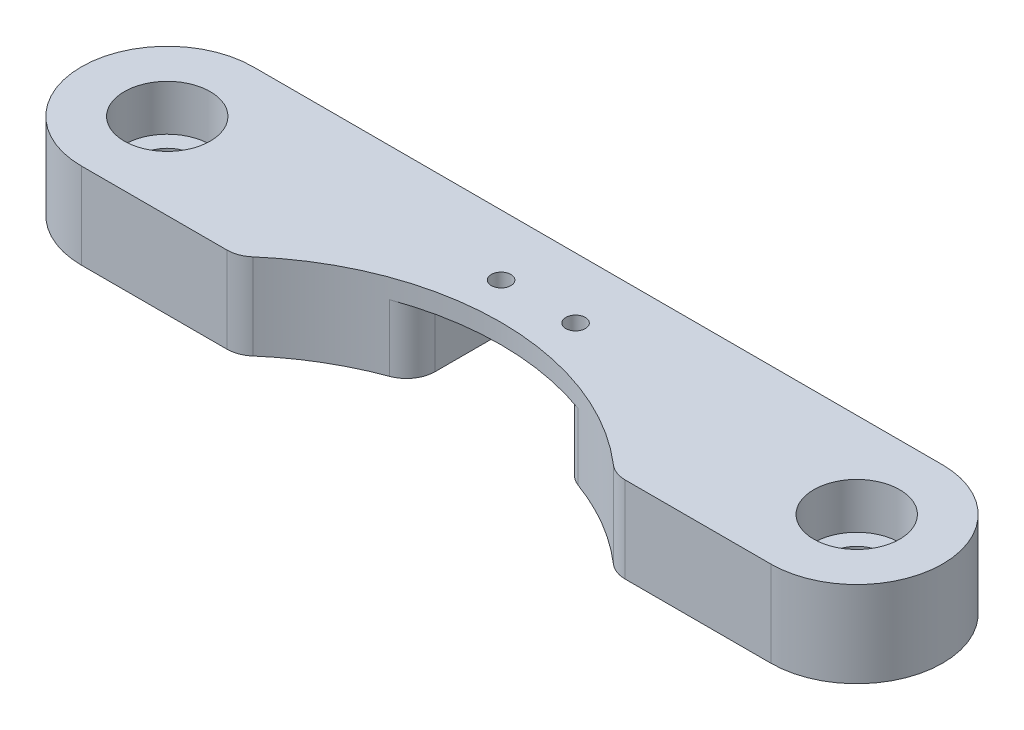
ISO-10303-21;
HEADER;
FILE_DESCRIPTION(('STEP AP214'),'2;1');
FILE_NAME('part.step','',(''),(''),'','','');
FILE_SCHEMA(('AUTOMOTIVE_DESIGN { 1 0 10303 214 1 1 1 1 }'));
ENDSEC;
DATA;
#1=APPLICATION_CONTEXT('core data for automotive mechanical design processes');
#2=APPLICATION_PROTOCOL_DEFINITION('international standard','automotive_design',2000,#1);
#3=PRODUCT_CONTEXT('',#1,'mechanical');
#4=PRODUCT('Part','Part','',(#3));
#5=PRODUCT_RELATED_PRODUCT_CATEGORY('part','',(#4));
#6=PRODUCT_DEFINITION_FORMATION('','',#4);
#7=PRODUCT_DEFINITION_CONTEXT('part definition',#1,'design');
#8=PRODUCT_DEFINITION('design','',#6,#7);
#9=PRODUCT_DEFINITION_SHAPE('','',#8);
#10=(LENGTH_UNIT() NAMED_UNIT(*) SI_UNIT(.MILLI.,.METRE.));
#11=(NAMED_UNIT(*) PLANE_ANGLE_UNIT() SI_UNIT($,.RADIAN.));
#12=(NAMED_UNIT(*) SI_UNIT($,.STERADIAN.) SOLID_ANGLE_UNIT());
#13=UNCERTAINTY_MEASURE_WITH_UNIT(LENGTH_MEASURE(1.E-05),#10,'distance_accuracy_value','');
#14=(GEOMETRIC_REPRESENTATION_CONTEXT(3) GLOBAL_UNCERTAINTY_ASSIGNED_CONTEXT((#13)) GLOBAL_UNIT_ASSIGNED_CONTEXT((#10,
#11,#12)) REPRESENTATION_CONTEXT('',''));
#15=CARTESIAN_POINT('',(0.,0.,0.));
#16=DIRECTION('',(0.,0.,1.));
#17=DIRECTION('',(1.,0.,0.));
#18=AXIS2_PLACEMENT_3D('',#15,#16,#17);
#19=CARTESIAN_POINT('',(30.,52.5,-25.));
#20=DIRECTION('',(0.,-1.,0.));
#21=DIRECTION('',(0.,0.,-1.));
#22=AXIS2_PLACEMENT_3D('',#19,#20,#21);
#23=CYLINDRICAL_SURFACE('',#22,2.25);
#24=CARTESIAN_POINT('',(30.,45.,-25.));
#25=DIRECTION('',(0.,1.,0.));
#26=DIRECTION('',(0.,0.,1.));
#27=AXIS2_PLACEMENT_3D('',#24,#25,#26);
#28=CIRCLE('',#27,2.25);
#29=CARTESIAN_POINT('',(30.,45.,-22.75));
#30=VERTEX_POINT('',#29);
#31=EDGE_CURVE('E305',#30,#30,#28,.T.);
#32=ORIENTED_EDGE('',*,*,#31,.F.);
#33=EDGE_LOOP('',(#32));
#34=FACE_BOUND('',#33,.T.);
#35=CARTESIAN_POINT('',(30.,48.5,-25.));
#36=DIRECTION('',(0.,1.,0.));
#37=DIRECTION('',(0.,0.,1.));
#38=AXIS2_PLACEMENT_3D('',#35,#36,#37);
#39=CIRCLE('',#38,2.25);
#40=CARTESIAN_POINT('',(30.,48.5,-22.75));
#41=VERTEX_POINT('',#40);
#42=EDGE_CURVE('E39',#41,#41,#39,.T.);
#43=ORIENTED_EDGE('',*,*,#42,.T.);
#44=EDGE_LOOP('',(#43));
#45=FACE_BOUND('',#44,.T.);
#46=ADVANCED_FACE('F35',(#34,#45),#23,.F.);
#47=CARTESIAN_POINT('',(-30.2,52.5,-25.));
#48=DIRECTION('',(0.,-1.,0.));
#49=DIRECTION('',(0.,0.,-1.));
#50=AXIS2_PLACEMENT_3D('',#47,#48,#49);
#51=CYLINDRICAL_SURFACE('',#50,2.25);
#52=CARTESIAN_POINT('',(-30.2,45.,-25.));
#53=DIRECTION('',(0.,1.,0.));
#54=DIRECTION('',(0.,0.,1.));
#55=AXIS2_PLACEMENT_3D('',#52,#53,#54);
#56=CIRCLE('',#55,2.25);
#57=CARTESIAN_POINT('',(-30.2,45.,-22.75));
#58=VERTEX_POINT('',#57);
#59=EDGE_CURVE('E300',#58,#58,#56,.T.);
#60=ORIENTED_EDGE('',*,*,#59,.F.);
#61=EDGE_LOOP('',(#60));
#62=FACE_BOUND('',#61,.T.);
#63=CARTESIAN_POINT('',(-30.2,48.5,-25.));
#64=DIRECTION('',(0.,1.,0.));
#65=DIRECTION('',(0.,0.,1.));
#66=AXIS2_PLACEMENT_3D('',#63,#64,#65);
#67=CIRCLE('',#66,2.25);
#68=CARTESIAN_POINT('',(-30.2,48.5,-22.75));
#69=VERTEX_POINT('',#68);
#70=EDGE_CURVE('E259',#69,#69,#67,.T.);
#71=ORIENTED_EDGE('',*,*,#70,.T.);
#72=EDGE_LOOP('',(#71));
#73=FACE_BOUND('',#72,.T.);
#74=ADVANCED_FACE('F342',(#62,#73),#51,.F.);
#75=CARTESIAN_POINT('',(-0.100000000000003,45.,0.));
#76=DIRECTION('',(0.,1.,0.));
#77=DIRECTION('',(0.,0.,1.));
#78=AXIS2_PLACEMENT_3D('',#75,#76,#77);
#79=PLANE('',#78);
#80=ORIENTED_EDGE('',*,*,#59,.T.);
#81=EDGE_LOOP('',(#80));
#82=FACE_BOUND('',#81,.T.);
#83=DIRECTION('',(-1.,0.,0.));
#84=VECTOR('',#83,1.);
#85=CARTESIAN_POINT('',(-30.2,45.,-32.5));
#86=LINE('',#85,#84);
#87=CARTESIAN_POINT('',(-9.2,45.,-32.5));
#88=VERTEX_POINT('',#87);
#89=CARTESIAN_POINT('',(-30.2,45.,-32.5));
#90=VERTEX_POINT('',#89);
#91=EDGE_CURVE('E190',#88,#90,#86,.T.);
#92=ORIENTED_EDGE('',*,*,#91,.F.);
#93=CARTESIAN_POINT('',(-9.2,45.,-30.));
#94=DIRECTION('',(0.,1.,0.));
#95=DIRECTION('',(0.,0.,1.));
#96=AXIS2_PLACEMENT_3D('',#93,#94,#95);
#97=CIRCLE('',#96,2.5);
#98=CARTESIAN_POINT('',(-6.7,45.,-30.));
#99=VERTEX_POINT('',#98);
#100=EDGE_CURVE('E240',#88,#99,#97,.F.);
#101=ORIENTED_EDGE('',*,*,#100,.T.);
#102=DIRECTION('',(0.,0.,1.));
#103=VECTOR('',#102,1.);
#104=CARTESIAN_POINT('',(-6.7,45.,-23.0746614276353));
#105=LINE('',#104,#103);
#106=CARTESIAN_POINT('',(-6.7,45.,-24.888551585016));
#107=VERTEX_POINT('',#106);
#108=EDGE_CURVE('E265',#99,#107,#105,.T.);
#109=ORIENTED_EDGE('',*,*,#108,.T.);
#110=CARTESIAN_POINT('',(-9.2,45.,-24.888551585016));
#111=DIRECTION('',(0.,1.,0.));
#112=DIRECTION('',(0.,0.,1.));
#113=AXIS2_PLACEMENT_3D('',#110,#111,#112);
#114=CIRCLE('',#113,2.5);
#115=CARTESIAN_POINT('',(-8.34150943396227,45.,-22.5405750203918));
#116=VERTEX_POINT('',#115);
#117=EDGE_CURVE('E236',#107,#116,#114,.F.);
#118=ORIENTED_EDGE('',*,*,#117,.T.);
#119=CARTESIAN_POINT('',(-0.100000000000003,45.,0.));
#120=DIRECTION('',(0.,-1.,0.));
#121=DIRECTION('',(0.,0.,1.));
#122=AXIS2_PLACEMENT_3D('',#119,#120,#121);
#123=CIRCLE('',#122,24.);
#124=CARTESIAN_POINT('',(-15.8452123629106,45.,-18.1132075471698));
#125=VERTEX_POINT('',#124);
#126=EDGE_CURVE('E183',#125,#116,#123,.T.);
#127=ORIENTED_EDGE('',*,*,#126,.F.);
#128=CARTESIAN_POINT('',(-17.4853386507137,45.,-20.));
#129=DIRECTION('',(0.,1.,0.));
#130=DIRECTION('',(0.,0.,1.));
#131=AXIS2_PLACEMENT_3D('',#128,#129,#130);
#132=CIRCLE('',#131,2.5);
#133=CARTESIAN_POINT('',(-17.4853386507137,45.,-17.5));
#134=VERTEX_POINT('',#133);
#135=EDGE_CURVE('E238',#125,#134,#132,.F.);
#136=ORIENTED_EDGE('',*,*,#135,.T.);
#137=DIRECTION('',(1.,0.,0.));
#138=VECTOR('',#137,1.);
#139=CARTESIAN_POINT('',(-16.5240677056569,45.,-17.5));
#140=LINE('',#139,#138);
#141=CARTESIAN_POINT('',(-30.2,45.,-17.5));
#142=VERTEX_POINT('',#141);
#143=EDGE_CURVE('E196',#142,#134,#140,.T.);
#144=ORIENTED_EDGE('',*,*,#143,.F.);
#145=CARTESIAN_POINT('',(-30.2,45.,-25.));
#146=DIRECTION('',(0.,1.,0.));
#147=DIRECTION('',(0.,0.,1.));
#148=AXIS2_PLACEMENT_3D('',#145,#146,#147);
#149=CIRCLE('',#148,7.5);
#150=EDGE_CURVE('E194',#90,#142,#149,.T.);
#151=ORIENTED_EDGE('',*,*,#150,.F.);
#152=EDGE_LOOP('',(#92,#101,#109,#118,#127,#136,#144,#151));
#153=FACE_BOUND('',#152,.T.);
#154=ADVANCED_FACE('F348',(#82,#153),#79,.F.);
#155=ORIENTED_EDGE('',*,*,#31,.T.);
#156=EDGE_LOOP('',(#155));
#157=FACE_BOUND('',#156,.T.);
#158=CARTESIAN_POINT('',(8.14150943396226,45.,-22.5405750203918));
#159=VERTEX_POINT('',#158);
#160=CARTESIAN_POINT('',(15.6452123629106,45.,-18.1132075471698));
#161=VERTEX_POINT('',#160);
#162=EDGE_CURVE('E186',#159,#161,#123,.T.);
#163=ORIENTED_EDGE('',*,*,#162,.F.);
#164=CARTESIAN_POINT('',(9.,45.,-24.888551585016));
#165=DIRECTION('',(0.,1.,0.));
#166=DIRECTION('',(0.,0.,1.));
#167=AXIS2_PLACEMENT_3D('',#164,#165,#166);
#168=CIRCLE('',#167,2.5);
#169=CARTESIAN_POINT('',(6.5,45.,-24.888551585016));
#170=VERTEX_POINT('',#169);
#171=EDGE_CURVE('E223',#159,#170,#168,.F.);
#172=ORIENTED_EDGE('',*,*,#171,.T.);
#173=DIRECTION('',(0.,0.,-1.));
#174=VECTOR('',#173,1.);
#175=CARTESIAN_POINT('',(6.5,45.,-23.0746614276353));
#176=LINE('',#175,#174);
#177=CARTESIAN_POINT('',(6.5,45.,-30.));
#178=VERTEX_POINT('',#177);
#179=EDGE_CURVE('E284',#170,#178,#176,.T.);
#180=ORIENTED_EDGE('',*,*,#179,.T.);
#181=CARTESIAN_POINT('',(9.,45.,-30.));
#182=DIRECTION('',(0.,1.,0.));
#183=DIRECTION('',(0.,0.,1.));
#184=AXIS2_PLACEMENT_3D('',#181,#182,#183);
#185=CIRCLE('',#184,2.5);
#186=CARTESIAN_POINT('',(8.99999999999999,45.,-32.5));
#187=VERTEX_POINT('',#186);
#188=EDGE_CURVE('E221',#178,#187,#185,.F.);
#189=ORIENTED_EDGE('',*,*,#188,.T.);
#190=CARTESIAN_POINT('',(30.,45.,-32.5));
#191=VERTEX_POINT('',#190);
#192=EDGE_CURVE('E191',#191,#187,#86,.T.);
#193=ORIENTED_EDGE('',*,*,#192,.F.);
#194=CARTESIAN_POINT('',(30.,45.,-25.));
#195=DIRECTION('',(0.,1.,0.));
#196=DIRECTION('',(0.,0.,1.));
#197=AXIS2_PLACEMENT_3D('',#194,#195,#196);
#198=CIRCLE('',#197,7.50000000000001);
#199=CARTESIAN_POINT('',(30.,45.,-17.5));
#200=VERTEX_POINT('',#199);
#201=EDGE_CURVE('E188',#200,#191,#198,.T.);
#202=ORIENTED_EDGE('',*,*,#201,.F.);
#203=DIRECTION('',(1.,0.,0.));
#204=VECTOR('',#203,1.);
#205=CARTESIAN_POINT('',(30.,45.,-17.5));
#206=LINE('',#205,#204);
#207=CARTESIAN_POINT('',(17.2853386507138,45.,-17.5));
#208=VERTEX_POINT('',#207);
#209=EDGE_CURVE('E164',#208,#200,#206,.T.);
#210=ORIENTED_EDGE('',*,*,#209,.F.);
#211=CARTESIAN_POINT('',(17.2853386507137,45.,-20.));
#212=DIRECTION('',(0.,1.,0.));
#213=DIRECTION('',(0.,0.,1.));
#214=AXIS2_PLACEMENT_3D('',#211,#212,#213);
#215=CIRCLE('',#214,2.5);
#216=EDGE_CURVE('E219',#208,#161,#215,.F.);
#217=ORIENTED_EDGE('',*,*,#216,.T.);
#218=EDGE_LOOP('',(#163,#172,#180,#189,#193,#202,#210,#217));
#219=FACE_BOUND('',#218,.T.);
#220=ADVANCED_FACE('F315',(#157,#219),#79,.F.);
#221=CARTESIAN_POINT('',(-0.100000000000003,52.5,0.));
#222=DIRECTION('',(0.,-1.,0.));
#223=DIRECTION('',(0.,0.,-1.));
#224=AXIS2_PLACEMENT_3D('',#221,#222,#223);
#225=CYLINDRICAL_SURFACE('',#224,24.);
#226=CARTESIAN_POINT('',(-0.100000000000003,50.8,0.));
#227=DIRECTION('',(0.,-1.,0.));
#228=DIRECTION('',(0.,0.,-1.));
#229=AXIS2_PLACEMENT_3D('',#226,#227,#228);
#230=CIRCLE('',#229,24.);
#231=CARTESIAN_POINT('',(8.14150943396226,50.8,-22.5405750203918));
#232=VERTEX_POINT('',#231);
#233=CARTESIAN_POINT('',(-8.34150943396227,50.8,-22.5405750203918));
#234=VERTEX_POINT('',#233);
#235=EDGE_CURVE('E294',#232,#234,#230,.F.);
#236=ORIENTED_EDGE('',*,*,#235,.F.);
#237=DIRECTION('',(0.,-1.,0.));
#238=VECTOR('',#237,1.);
#239=CARTESIAN_POINT('',(8.14150943396226,52.5,-22.5405750203918));
#240=LINE('',#239,#238);
#241=EDGE_CURVE('E216',#232,#159,#240,.T.);
#242=ORIENTED_EDGE('',*,*,#241,.T.);
#243=ORIENTED_EDGE('',*,*,#162,.T.);
#244=DIRECTION('',(0.,-1.,0.));
#245=VECTOR('',#244,1.);
#246=CARTESIAN_POINT('',(15.6452123629106,52.5,-18.1132075471698));
#247=LINE('',#246,#245);
#248=CARTESIAN_POINT('',(15.6452123629106,52.5,-18.1132075471698));
#249=VERTEX_POINT('',#248);
#250=EDGE_CURVE('E167',#161,#249,#247,.F.);
#251=ORIENTED_EDGE('',*,*,#250,.T.);
#252=CARTESIAN_POINT('',(-0.100000000000003,52.5,0.));
#253=DIRECTION('',(0.,-1.,0.));
#254=DIRECTION('',(0.,0.,1.));
#255=AXIS2_PLACEMENT_3D('',#252,#253,#254);
#256=CIRCLE('',#255,24.);
#257=CARTESIAN_POINT('',(-15.8452123629106,52.5,-18.1132075471698));
#258=VERTEX_POINT('',#257);
#259=EDGE_CURVE('E158',#258,#249,#256,.T.);
#260=ORIENTED_EDGE('',*,*,#259,.F.);
#261=DIRECTION('',(0.,-1.,0.));
#262=VECTOR('',#261,1.);
#263=CARTESIAN_POINT('',(-15.8452123629106,52.5,-18.1132075471698));
#264=LINE('',#263,#262);
#265=EDGE_CURVE('E213',#258,#125,#264,.T.);
#266=ORIENTED_EDGE('',*,*,#265,.T.);
#267=ORIENTED_EDGE('',*,*,#126,.T.);
#268=DIRECTION('',(0.,-1.,0.));
#269=VECTOR('',#268,1.);
#270=CARTESIAN_POINT('',(-8.34150943396227,52.5,-22.5405750203918));
#271=LINE('',#270,#269);
#272=EDGE_CURVE('E210',#116,#234,#271,.F.);
#273=ORIENTED_EDGE('',*,*,#272,.T.);
#274=EDGE_LOOP('',(#236,#242,#243,#251,#260,#266,#267,#273));
#275=FACE_BOUND('',#274,.T.);
#276=ADVANCED_FACE('F363',(#275),#225,.F.);
#277=CARTESIAN_POINT('',(-30.2,52.5,-32.5));
#278=DIRECTION('',(0.,0.,1.));
#279=DIRECTION('',(1.,0.,0.));
#280=AXIS2_PLACEMENT_3D('',#277,#278,#279);
#281=PLANE('',#280);
#282=ORIENTED_EDGE('',*,*,#192,.T.);
#283=DIRECTION('',(0.,-1.,0.));
#284=VECTOR('',#283,1.);
#285=CARTESIAN_POINT('',(9.,50.8,-32.5));
#286=LINE('',#285,#284);
#287=CARTESIAN_POINT('',(9.,50.8,-32.5));
#288=VERTEX_POINT('',#287);
#289=EDGE_CURVE('E233',#187,#288,#286,.F.);
#290=ORIENTED_EDGE('',*,*,#289,.T.);
#291=DIRECTION('',(-1.,0.,0.));
#292=VECTOR('',#291,1.);
#293=CARTESIAN_POINT('',(-6.7,50.8,-32.5));
#294=LINE('',#293,#292);
#295=CARTESIAN_POINT('',(-9.2,50.8,-32.5));
#296=VERTEX_POINT('',#295);
#297=EDGE_CURVE('E208',#288,#296,#294,.T.);
#298=ORIENTED_EDGE('',*,*,#297,.T.);
#299=DIRECTION('',(0.,-1.,0.));
#300=VECTOR('',#299,1.);
#301=CARTESIAN_POINT('',(-9.2,45.,-32.5));
#302=LINE('',#301,#300);
#303=EDGE_CURVE('E230',#296,#88,#302,.T.);
#304=ORIENTED_EDGE('',*,*,#303,.T.);
#305=ORIENTED_EDGE('',*,*,#91,.T.);
#306=DIRECTION('',(0.,-1.,0.));
#307=VECTOR('',#306,1.);
#308=CARTESIAN_POINT('',(-30.2,52.5,-32.5));
#309=LINE('',#308,#307);
#310=CARTESIAN_POINT('',(-30.2,52.5,-32.5));
#311=VERTEX_POINT('',#310);
#312=EDGE_CURVE('E200',#311,#90,#309,.T.);
#313=ORIENTED_EDGE('',*,*,#312,.F.);
#314=DIRECTION('',(-1.,0.,0.));
#315=VECTOR('',#314,1.);
#316=CARTESIAN_POINT('',(-30.2,52.5,-32.5));
#317=LINE('',#316,#315);
#318=CARTESIAN_POINT('',(30.,52.5,-32.5));
#319=VERTEX_POINT('',#318);
#320=EDGE_CURVE('E173',#319,#311,#317,.T.);
#321=ORIENTED_EDGE('',*,*,#320,.F.);
#322=DIRECTION('',(0.,-1.,0.));
#323=VECTOR('',#322,1.);
#324=CARTESIAN_POINT('',(30.,52.5,-32.5));
#325=LINE('',#324,#323);
#326=EDGE_CURVE('E168',#319,#191,#325,.T.);
#327=ORIENTED_EDGE('',*,*,#326,.T.);
#328=EDGE_LOOP('',(#282,#290,#298,#304,#305,#313,#321,#327));
#329=FACE_BOUND('',#328,.T.);
#330=ADVANCED_FACE('F319',(#329),#281,.F.);
#331=CARTESIAN_POINT('',(3.25,52.5,-27.2));
#332=DIRECTION('',(0.,-1.,0.));
#333=DIRECTION('',(0.,0.,-1.));
#334=AXIS2_PLACEMENT_3D('',#331,#332,#333);
#335=CYLINDRICAL_SURFACE('',#334,0.85);
#336=CARTESIAN_POINT('',(3.25,52.5,-27.2));
#337=DIRECTION('',(0.,-1.,0.));
#338=DIRECTION('',(0.,0.,-1.));
#339=AXIS2_PLACEMENT_3D('',#336,#337,#338);
#340=CIRCLE('',#339,0.85);
#341=CARTESIAN_POINT('',(3.25,52.5,-28.05));
#342=VERTEX_POINT('',#341);
#343=EDGE_CURVE('E296',#342,#342,#340,.T.);
#344=ORIENTED_EDGE('',*,*,#343,.F.);
#345=EDGE_LOOP('',(#344));
#346=FACE_BOUND('',#345,.T.);
#347=CARTESIAN_POINT('',(3.25,50.8,-27.2));
#348=DIRECTION('',(0.,-1.,0.));
#349=DIRECTION('',(0.,0.,-1.));
#350=AXIS2_PLACEMENT_3D('',#347,#348,#349);
#351=CIRCLE('',#350,0.85);
#352=CARTESIAN_POINT('',(3.25,50.8,-28.05));
#353=VERTEX_POINT('',#352);
#354=EDGE_CURVE('E207',#353,#353,#351,.F.);
#355=ORIENTED_EDGE('',*,*,#354,.F.);
#356=EDGE_LOOP('',(#355));
#357=FACE_BOUND('',#356,.T.);
#358=ADVANCED_FACE('F409',(#346,#357),#335,.F.);
#359=CARTESIAN_POINT('',(-3.25,52.5,-27.2));
#360=DIRECTION('',(0.,-1.,0.));
#361=DIRECTION('',(0.,0.,-1.));
#362=AXIS2_PLACEMENT_3D('',#359,#360,#361);
#363=CYLINDRICAL_SURFACE('',#362,0.85);
#364=CARTESIAN_POINT('',(-3.25,52.5,-27.2));
#365=DIRECTION('',(0.,-1.,0.));
#366=DIRECTION('',(0.,0.,-1.));
#367=AXIS2_PLACEMENT_3D('',#364,#365,#366);
#368=CIRCLE('',#367,0.85);
#369=CARTESIAN_POINT('',(-3.25,52.5,-28.05));
#370=VERTEX_POINT('',#369);
#371=EDGE_CURVE('E297',#370,#370,#368,.T.);
#372=ORIENTED_EDGE('',*,*,#371,.F.);
#373=EDGE_LOOP('',(#372));
#374=FACE_BOUND('',#373,.T.);
#375=CARTESIAN_POINT('',(-3.25,50.8,-27.2));
#376=DIRECTION('',(0.,-1.,0.));
#377=DIRECTION('',(0.,0.,-1.));
#378=AXIS2_PLACEMENT_3D('',#375,#376,#377);
#379=CIRCLE('',#378,0.85);
#380=CARTESIAN_POINT('',(-3.25,50.8,-28.05));
#381=VERTEX_POINT('',#380);
#382=EDGE_CURVE('E204',#381,#381,#379,.F.);
#383=ORIENTED_EDGE('',*,*,#382,.F.);
#384=EDGE_LOOP('',(#383));
#385=FACE_BOUND('',#384,.T.);
#386=ADVANCED_FACE('F356',(#374,#385),#363,.F.);
#387=CARTESIAN_POINT('',(-0.100000000000003,52.5,0.));
#388=DIRECTION('',(0.,1.,0.));
#389=DIRECTION('',(0.,0.,1.));
#390=AXIS2_PLACEMENT_3D('',#387,#388,#389);
#391=PLANE('',#390);
#392=CARTESIAN_POINT('',(-30.2,52.5,-25.));
#393=DIRECTION('',(0.,1.,0.));
#394=DIRECTION('',(0.,0.,1.));
#395=AXIS2_PLACEMENT_3D('',#392,#393,#394);
#396=CIRCLE('',#395,3.75);
#397=CARTESIAN_POINT('',(-30.2,52.5,-21.25));
#398=VERTEX_POINT('',#397);
#399=EDGE_CURVE('E267',#398,#398,#396,.T.);
#400=ORIENTED_EDGE('',*,*,#399,.F.);
#401=EDGE_LOOP('',(#400));
#402=FACE_BOUND('',#401,.T.);
#403=CARTESIAN_POINT('',(30.,52.5,-25.));
#404=DIRECTION('',(0.,1.,0.));
#405=DIRECTION('',(0.,0.,1.));
#406=AXIS2_PLACEMENT_3D('',#403,#404,#405);
#407=CIRCLE('',#406,3.75);
#408=CARTESIAN_POINT('',(30.,52.5,-21.25));
#409=VERTEX_POINT('',#408);
#410=EDGE_CURVE('E277',#409,#409,#407,.T.);
#411=ORIENTED_EDGE('',*,*,#410,.F.);
#412=EDGE_LOOP('',(#411));
#413=FACE_BOUND('',#412,.T.);
#414=ORIENTED_EDGE('',*,*,#371,.T.);
#415=EDGE_LOOP('',(#414));
#416=FACE_BOUND('',#415,.T.);
#417=ORIENTED_EDGE('',*,*,#343,.T.);
#418=EDGE_LOOP('',(#417));
#419=FACE_BOUND('',#418,.T.);
#420=DIRECTION('',(1.,0.,0.));
#421=VECTOR('',#420,1.);
#422=CARTESIAN_POINT('',(-16.5240677056569,52.5,-17.5));
#423=LINE('',#422,#421);
#424=CARTESIAN_POINT('',(-30.2,52.5,-17.5));
#425=VERTEX_POINT('',#424);
#426=CARTESIAN_POINT('',(-17.4853386507137,52.5,-17.5));
#427=VERTEX_POINT('',#426);
#428=EDGE_CURVE('E180',#425,#427,#423,.T.);
#429=ORIENTED_EDGE('',*,*,#428,.T.);
#430=CARTESIAN_POINT('',(-17.4853386507137,52.5,-20.));
#431=DIRECTION('',(0.,1.,0.));
#432=DIRECTION('',(0.,0.,1.));
#433=AXIS2_PLACEMENT_3D('',#430,#431,#432);
#434=CIRCLE('',#433,2.5);
#435=EDGE_CURVE('E249',#427,#258,#434,.T.);
#436=ORIENTED_EDGE('',*,*,#435,.T.);
#437=ORIENTED_EDGE('',*,*,#259,.T.);
#438=CARTESIAN_POINT('',(17.2853386507137,52.5,-20.));
#439=DIRECTION('',(0.,1.,0.));
#440=DIRECTION('',(0.,0.,1.));
#441=AXIS2_PLACEMENT_3D('',#438,#439,#440);
#442=CIRCLE('',#441,2.5);
#443=CARTESIAN_POINT('',(17.2853386507138,52.5,-17.5));
#444=VERTEX_POINT('',#443);
#445=EDGE_CURVE('E52',#249,#444,#442,.T.);
#446=ORIENTED_EDGE('',*,*,#445,.T.);
#447=DIRECTION('',(1.,0.,0.));
#448=VECTOR('',#447,1.);
#449=CARTESIAN_POINT('',(30.,52.5,-17.5));
#450=LINE('',#449,#448);
#451=CARTESIAN_POINT('',(30.,52.5,-17.5));
#452=VERTEX_POINT('',#451);
#453=EDGE_CURVE('E149',#444,#452,#450,.T.);
#454=ORIENTED_EDGE('',*,*,#453,.T.);
#455=CARTESIAN_POINT('',(30.,52.5,-25.));
#456=DIRECTION('',(0.,1.,0.));
#457=DIRECTION('',(0.,0.,1.));
#458=AXIS2_PLACEMENT_3D('',#455,#456,#457);
#459=CIRCLE('',#458,7.50000000000001);
#460=EDGE_CURVE('E153',#452,#319,#459,.T.);
#461=ORIENTED_EDGE('',*,*,#460,.T.);
#462=ORIENTED_EDGE('',*,*,#320,.T.);
#463=CARTESIAN_POINT('',(-30.2,52.5,-25.));
#464=DIRECTION('',(0.,1.,0.));
#465=DIRECTION('',(0.,0.,1.));
#466=AXIS2_PLACEMENT_3D('',#463,#464,#465);
#467=CIRCLE('',#466,7.5);
#468=EDGE_CURVE('E175',#311,#425,#467,.T.);
#469=ORIENTED_EDGE('',*,*,#468,.T.);
#470=EDGE_LOOP('',(#429,#436,#437,#446,#454,#461,#462,#469));
#471=FACE_BOUND('',#470,.T.);
#472=ADVANCED_FACE('F151',(#402,#413,#416,#419,#471),#391,.T.);
#473=CARTESIAN_POINT('',(30.,52.5,-17.5));
#474=DIRECTION('',(0.,0.,-1.));
#475=DIRECTION('',(-1.,0.,0.));
#476=AXIS2_PLACEMENT_3D('',#473,#474,#475);
#477=PLANE('',#476);
#478=ORIENTED_EDGE('',*,*,#453,.F.);
#479=DIRECTION('',(0.,-1.,0.));
#480=VECTOR('',#479,1.);
#481=CARTESIAN_POINT('',(17.2853386507137,52.5,-17.5));
#482=LINE('',#481,#480);
#483=EDGE_CURVE('E251',#444,#208,#482,.T.);
#484=ORIENTED_EDGE('',*,*,#483,.T.);
#485=ORIENTED_EDGE('',*,*,#209,.T.);
#486=DIRECTION('',(0.,-1.,0.));
#487=VECTOR('',#486,1.);
#488=CARTESIAN_POINT('',(30.,52.5,-17.5));
#489=LINE('',#488,#487);
#490=EDGE_CURVE('E161',#452,#200,#489,.T.);
#491=ORIENTED_EDGE('',*,*,#490,.F.);
#492=EDGE_LOOP('',(#478,#484,#485,#491));
#493=FACE_BOUND('',#492,.T.);
#494=ADVANCED_FACE('F162',(#493),#477,.F.);
#495=CARTESIAN_POINT('',(30.,52.5,-25.));
#496=DIRECTION('',(0.,-1.,0.));
#497=DIRECTION('',(0.,0.,-1.));
#498=AXIS2_PLACEMENT_3D('',#495,#496,#497);
#499=CYLINDRICAL_SURFACE('',#498,7.50000000000001);
#500=ORIENTED_EDGE('',*,*,#201,.T.);
#501=ORIENTED_EDGE('',*,*,#326,.F.);
#502=ORIENTED_EDGE('',*,*,#460,.F.);
#503=ORIENTED_EDGE('',*,*,#490,.T.);
#504=EDGE_LOOP('',(#500,#501,#502,#503));
#505=FACE_BOUND('',#504,.T.);
#506=ADVANCED_FACE('F170',(#505),#499,.T.);
#507=CARTESIAN_POINT('',(-30.2,52.5,-25.));
#508=DIRECTION('',(0.,-1.,0.));
#509=DIRECTION('',(0.,0.,-1.));
#510=AXIS2_PLACEMENT_3D('',#507,#508,#509);
#511=CYLINDRICAL_SURFACE('',#510,7.5);
#512=ORIENTED_EDGE('',*,*,#150,.T.);
#513=DIRECTION('',(0.,-1.,0.));
#514=VECTOR('',#513,1.);
#515=CARTESIAN_POINT('',(-30.2,52.5,-17.5));
#516=LINE('',#515,#514);
#517=EDGE_CURVE('E182',#425,#142,#516,.T.);
#518=ORIENTED_EDGE('',*,*,#517,.F.);
#519=ORIENTED_EDGE('',*,*,#468,.F.);
#520=ORIENTED_EDGE('',*,*,#312,.T.);
#521=EDGE_LOOP('',(#512,#518,#519,#520));
#522=FACE_BOUND('',#521,.T.);
#523=ADVANCED_FACE('F325',(#522),#511,.T.);
#524=CARTESIAN_POINT('',(-16.5240677056569,52.5,-17.5));
#525=DIRECTION('',(0.,0.,-1.));
#526=DIRECTION('',(0.,1.,0.));
#527=AXIS2_PLACEMENT_3D('',#524,#525,#526);
#528=PLANE('',#527);
#529=ORIENTED_EDGE('',*,*,#143,.T.);
#530=DIRECTION('',(0.,-1.,0.));
#531=VECTOR('',#530,1.);
#532=CARTESIAN_POINT('',(-17.4853386507137,52.5,-17.5));
#533=LINE('',#532,#531);
#534=EDGE_CURVE('E60',#134,#427,#533,.F.);
#535=ORIENTED_EDGE('',*,*,#534,.T.);
#536=ORIENTED_EDGE('',*,*,#428,.F.);
#537=ORIENTED_EDGE('',*,*,#517,.T.);
#538=EDGE_LOOP('',(#529,#535,#536,#537));
#539=FACE_BOUND('',#538,.T.);
#540=ADVANCED_FACE('F328',(#539),#528,.F.);
#541=CARTESIAN_POINT('',(0.,50.8,0.));
#542=DIRECTION('',(0.,-1.,0.));
#543=DIRECTION('',(0.,0.,-1.));
#544=AXIS2_PLACEMENT_3D('',#541,#542,#543);
#545=PLANE('',#544);
#546=ORIENTED_EDGE('',*,*,#354,.T.);
#547=EDGE_LOOP('',(#546));
#548=FACE_BOUND('',#547,.T.);
#549=ORIENTED_EDGE('',*,*,#382,.T.);
#550=EDGE_LOOP('',(#549));
#551=FACE_BOUND('',#550,.T.);
#552=ORIENTED_EDGE('',*,*,#235,.T.);
#553=CARTESIAN_POINT('',(-9.2,50.8,-24.888551585016));
#554=DIRECTION('',(0.,-1.,0.));
#555=DIRECTION('',(0.,0.,-1.));
#556=AXIS2_PLACEMENT_3D('',#553,#554,#555);
#557=CIRCLE('',#556,2.5);
#558=CARTESIAN_POINT('',(-6.7,50.8,-24.888551585016));
#559=VERTEX_POINT('',#558);
#560=EDGE_CURVE('E12',#234,#559,#557,.F.);
#561=ORIENTED_EDGE('',*,*,#560,.T.);
#562=DIRECTION('',(0.,0.,1.));
#563=VECTOR('',#562,1.);
#564=CARTESIAN_POINT('',(-6.7,50.8,-23.0746614276353));
#565=LINE('',#564,#563);
#566=CARTESIAN_POINT('',(-6.7,50.8,-30.));
#567=VERTEX_POINT('',#566);
#568=EDGE_CURVE('E280',#567,#559,#565,.T.);
#569=ORIENTED_EDGE('',*,*,#568,.F.);
#570=CARTESIAN_POINT('',(-9.2,50.8,-30.));
#571=DIRECTION('',(0.,-1.,0.));
#572=DIRECTION('',(0.,0.,-1.));
#573=AXIS2_PLACEMENT_3D('',#570,#571,#572);
#574=CIRCLE('',#573,2.5);
#575=EDGE_CURVE('E44',#567,#296,#574,.F.);
#576=ORIENTED_EDGE('',*,*,#575,.T.);
#577=ORIENTED_EDGE('',*,*,#297,.F.);
#578=CARTESIAN_POINT('',(9.,50.8,-30.));
#579=DIRECTION('',(0.,-1.,0.));
#580=DIRECTION('',(0.,0.,-1.));
#581=AXIS2_PLACEMENT_3D('',#578,#579,#580);
#582=CIRCLE('',#581,2.5);
#583=CARTESIAN_POINT('',(6.5,50.8,-30.));
#584=VERTEX_POINT('',#583);
#585=EDGE_CURVE('E256',#288,#584,#582,.F.);
#586=ORIENTED_EDGE('',*,*,#585,.T.);
#587=DIRECTION('',(0.,0.,-1.));
#588=VECTOR('',#587,1.);
#589=CARTESIAN_POINT('',(6.5,50.8,-23.0746614276353));
#590=LINE('',#589,#588);
#591=CARTESIAN_POINT('',(6.5,50.8,-24.888551585016));
#592=VERTEX_POINT('',#591);
#593=EDGE_CURVE('E283',#592,#584,#590,.T.);
#594=ORIENTED_EDGE('',*,*,#593,.F.);
#595=CARTESIAN_POINT('',(9.,50.8,-24.888551585016));
#596=DIRECTION('',(0.,-1.,0.));
#597=DIRECTION('',(0.,0.,-1.));
#598=AXIS2_PLACEMENT_3D('',#595,#596,#597);
#599=CIRCLE('',#598,2.5);
#600=EDGE_CURVE('E253',#592,#232,#599,.F.);
#601=ORIENTED_EDGE('',*,*,#600,.T.);
#602=EDGE_LOOP('',(#552,#561,#569,#576,#577,#586,#594,#601));
#603=FACE_BOUND('',#602,.T.);
#604=ADVANCED_FACE('F330',(#548,#551,#603),#545,.T.);
#605=CARTESIAN_POINT('',(-6.7,50.8,-23.0746614276353));
#606=DIRECTION('',(1.,0.,0.));
#607=DIRECTION('',(0.,1.,0.));
#608=AXIS2_PLACEMENT_3D('',#605,#606,#607);
#609=PLANE('',#608);
#610=ORIENTED_EDGE('',*,*,#108,.F.);
#611=DIRECTION('',(0.,-1.,0.));
#612=VECTOR('',#611,1.);
#613=CARTESIAN_POINT('',(-6.7,50.8,-30.));
#614=LINE('',#613,#612);
#615=EDGE_CURVE('E245',#99,#567,#614,.F.);
#616=ORIENTED_EDGE('',*,*,#615,.T.);
#617=ORIENTED_EDGE('',*,*,#568,.T.);
#618=DIRECTION('',(0.,1.,0.));
#619=VECTOR('',#618,1.);
#620=CARTESIAN_POINT('',(-6.7,45.,-24.888551585016));
#621=LINE('',#620,#619);
#622=EDGE_CURVE('E242',#559,#107,#621,.F.);
#623=ORIENTED_EDGE('',*,*,#622,.T.);
#624=EDGE_LOOP('',(#610,#616,#617,#623));
#625=FACE_BOUND('',#624,.T.);
#626=ADVANCED_FACE('F336',(#625),#609,.T.);
#627=CARTESIAN_POINT('',(6.5,50.8,-23.0746614276353));
#628=DIRECTION('',(-1.,0.,0.));
#629=DIRECTION('',(0.,0.,1.));
#630=AXIS2_PLACEMENT_3D('',#627,#628,#629);
#631=PLANE('',#630);
#632=ORIENTED_EDGE('',*,*,#179,.F.);
#633=DIRECTION('',(0.,1.,0.));
#634=VECTOR('',#633,1.);
#635=CARTESIAN_POINT('',(6.5,50.8,-24.888551585016));
#636=LINE('',#635,#634);
#637=EDGE_CURVE('E228',#170,#592,#636,.T.);
#638=ORIENTED_EDGE('',*,*,#637,.T.);
#639=ORIENTED_EDGE('',*,*,#593,.T.);
#640=DIRECTION('',(0.,-1.,0.));
#641=VECTOR('',#640,1.);
#642=CARTESIAN_POINT('',(6.5,45.,-30.));
#643=LINE('',#642,#641);
#644=EDGE_CURVE('E225',#584,#178,#643,.T.);
#645=ORIENTED_EDGE('',*,*,#644,.T.);
#646=EDGE_LOOP('',(#632,#638,#639,#645));
#647=FACE_BOUND('',#646,.T.);
#648=ADVANCED_FACE('F400',(#647),#631,.T.);
#649=CARTESIAN_POINT('',(9.,52.5,-24.888551585016));
#650=DIRECTION('',(0.,-1.,0.));
#651=DIRECTION('',(0.,0.,-1.));
#652=AXIS2_PLACEMENT_3D('',#649,#650,#651);
#653=CYLINDRICAL_SURFACE('',#652,2.5);
#654=ORIENTED_EDGE('',*,*,#600,.F.);
#655=ORIENTED_EDGE('',*,*,#637,.F.);
#656=ORIENTED_EDGE('',*,*,#171,.F.);
#657=ORIENTED_EDGE('',*,*,#241,.F.);
#658=EDGE_LOOP('',(#654,#655,#656,#657));
#659=FACE_BOUND('',#658,.T.);
#660=ADVANCED_FACE('F396',(#659),#653,.T.);
#661=CARTESIAN_POINT('',(9.,50.8,-30.));
#662=DIRECTION('',(0.,1.,0.));
#663=DIRECTION('',(0.,0.,1.));
#664=AXIS2_PLACEMENT_3D('',#661,#662,#663);
#665=CYLINDRICAL_SURFACE('',#664,2.5);
#666=ORIENTED_EDGE('',*,*,#585,.F.);
#667=ORIENTED_EDGE('',*,*,#289,.F.);
#668=ORIENTED_EDGE('',*,*,#188,.F.);
#669=ORIENTED_EDGE('',*,*,#644,.F.);
#670=EDGE_LOOP('',(#666,#667,#668,#669));
#671=FACE_BOUND('',#670,.T.);
#672=ADVANCED_FACE('F391',(#671),#665,.T.);
#673=CARTESIAN_POINT('',(-9.2,52.5,-30.));
#674=DIRECTION('',(0.,1.,0.));
#675=DIRECTION('',(0.,0.,1.));
#676=AXIS2_PLACEMENT_3D('',#673,#674,#675);
#677=CYLINDRICAL_SURFACE('',#676,2.5);
#678=ORIENTED_EDGE('',*,*,#575,.F.);
#679=ORIENTED_EDGE('',*,*,#615,.F.);
#680=ORIENTED_EDGE('',*,*,#100,.F.);
#681=ORIENTED_EDGE('',*,*,#303,.F.);
#682=EDGE_LOOP('',(#678,#679,#680,#681));
#683=FACE_BOUND('',#682,.T.);
#684=ADVANCED_FACE('F372',(#683),#677,.T.);
#685=CARTESIAN_POINT('',(-17.4853386507137,52.5,-20.));
#686=DIRECTION('',(0.,-1.,0.));
#687=DIRECTION('',(0.,0.,-1.));
#688=AXIS2_PLACEMENT_3D('',#685,#686,#687);
#689=CYLINDRICAL_SURFACE('',#688,2.5);
#690=ORIENTED_EDGE('',*,*,#435,.F.);
#691=ORIENTED_EDGE('',*,*,#534,.F.);
#692=ORIENTED_EDGE('',*,*,#135,.F.);
#693=ORIENTED_EDGE('',*,*,#265,.F.);
#694=EDGE_LOOP('',(#690,#691,#692,#693));
#695=FACE_BOUND('',#694,.T.);
#696=ADVANCED_FACE('F384',(#695),#689,.T.);
#697=CARTESIAN_POINT('',(-9.2,52.5,-24.888551585016));
#698=DIRECTION('',(0.,-1.,0.));
#699=DIRECTION('',(0.,0.,-1.));
#700=AXIS2_PLACEMENT_3D('',#697,#698,#699);
#701=CYLINDRICAL_SURFACE('',#700,2.5);
#702=ORIENTED_EDGE('',*,*,#560,.F.);
#703=ORIENTED_EDGE('',*,*,#272,.F.);
#704=ORIENTED_EDGE('',*,*,#117,.F.);
#705=ORIENTED_EDGE('',*,*,#622,.F.);
#706=EDGE_LOOP('',(#702,#703,#704,#705));
#707=FACE_BOUND('',#706,.T.);
#708=ADVANCED_FACE('F381',(#707),#701,.T.);
#709=CARTESIAN_POINT('',(17.2853386507137,52.5,-20.));
#710=DIRECTION('',(0.,-1.,0.));
#711=DIRECTION('',(0.,0.,-1.));
#712=AXIS2_PLACEMENT_3D('',#709,#710,#711);
#713=CYLINDRICAL_SURFACE('',#712,2.5);
#714=ORIENTED_EDGE('',*,*,#445,.F.);
#715=ORIENTED_EDGE('',*,*,#250,.F.);
#716=ORIENTED_EDGE('',*,*,#216,.F.);
#717=ORIENTED_EDGE('',*,*,#483,.F.);
#718=EDGE_LOOP('',(#714,#715,#716,#717));
#719=FACE_BOUND('',#718,.T.);
#720=ADVANCED_FACE('F37',(#719),#713,.T.);
#721=CARTESIAN_POINT('',(-30.2,48.5,-25.));
#722=DIRECTION('',(0.,1.,0.));
#723=DIRECTION('',(0.,0.,1.));
#724=AXIS2_PLACEMENT_3D('',#721,#722,#723);
#725=CYLINDRICAL_SURFACE('',#724,3.75);
#726=CARTESIAN_POINT('',(-30.2,48.5,-25.));
#727=DIRECTION('',(0.,1.,0.));
#728=DIRECTION('',(0.,0.,1.));
#729=AXIS2_PLACEMENT_3D('',#726,#727,#728);
#730=CIRCLE('',#729,3.75);
#731=CARTESIAN_POINT('',(-30.2,48.5,-21.25));
#732=VERTEX_POINT('',#731);
#733=EDGE_CURVE('E261',#732,#732,#730,.T.);
#734=ORIENTED_EDGE('',*,*,#733,.F.);
#735=EDGE_LOOP('',(#734));
#736=FACE_BOUND('',#735,.T.);
#737=ORIENTED_EDGE('',*,*,#399,.T.);
#738=EDGE_LOOP('',(#737));
#739=FACE_BOUND('',#738,.T.);
#740=ADVANCED_FACE('F436',(#736,#739),#725,.F.);
#741=CARTESIAN_POINT('',(-30.2,48.5,-25.));
#742=DIRECTION('',(0.,1.,0.));
#743=DIRECTION('',(0.,0.,1.));
#744=AXIS2_PLACEMENT_3D('',#741,#742,#743);
#745=PLANE('',#744);
#746=ORIENTED_EDGE('',*,*,#70,.F.);
#747=EDGE_LOOP('',(#746));
#748=FACE_BOUND('',#747,.T.);
#749=ORIENTED_EDGE('',*,*,#733,.T.);
#750=EDGE_LOOP('',(#749));
#751=FACE_BOUND('',#750,.T.);
#752=ADVANCED_FACE('F431',(#748,#751),#745,.T.);
#753=CARTESIAN_POINT('',(30.,48.5,-25.));
#754=DIRECTION('',(0.,1.,0.));
#755=DIRECTION('',(0.,0.,1.));
#756=AXIS2_PLACEMENT_3D('',#753,#754,#755);
#757=CYLINDRICAL_SURFACE('',#756,3.75);
#758=CARTESIAN_POINT('',(30.,48.5,-25.));
#759=DIRECTION('',(0.,1.,0.));
#760=DIRECTION('',(0.,0.,1.));
#761=AXIS2_PLACEMENT_3D('',#758,#759,#760);
#762=CIRCLE('',#761,3.75);
#763=CARTESIAN_POINT('',(30.,48.5,-21.25));
#764=VERTEX_POINT('',#763);
#765=EDGE_CURVE('E272',#764,#764,#762,.T.);
#766=ORIENTED_EDGE('',*,*,#765,.F.);
#767=EDGE_LOOP('',(#766));
#768=FACE_BOUND('',#767,.T.);
#769=ORIENTED_EDGE('',*,*,#410,.T.);
#770=EDGE_LOOP('',(#769));
#771=FACE_BOUND('',#770,.T.);
#772=ADVANCED_FACE('F427',(#768,#771),#757,.F.);
#773=CARTESIAN_POINT('',(30.,48.5,-25.));
#774=DIRECTION('',(0.,1.,0.));
#775=DIRECTION('',(0.,0.,1.));
#776=AXIS2_PLACEMENT_3D('',#773,#774,#775);
#777=PLANE('',#776);
#778=ORIENTED_EDGE('',*,*,#42,.F.);
#779=EDGE_LOOP('',(#778));
#780=FACE_BOUND('',#779,.T.);
#781=ORIENTED_EDGE('',*,*,#765,.T.);
#782=EDGE_LOOP('',(#781));
#783=FACE_BOUND('',#782,.T.);
#784=ADVANCED_FACE('F430',(#780,#783),#777,.T.);
#785=CLOSED_SHELL('',(#46,#74,#154,#220,#276,#330,#358,#386,#472,#494,#506,#523,#540,#604,#626,
#648,#660,#672,#684,#696,#708,#720,#740,#752,#772,#784));
#786=MANIFOLD_SOLID_BREP('B2',#785);
#787=ADVANCED_BREP_SHAPE_REPRESENTATION('',(#18,#786),#14);
#788=SHAPE_DEFINITION_REPRESENTATION(#9,#787);
ENDSEC;
END-ISO-10303-21;
